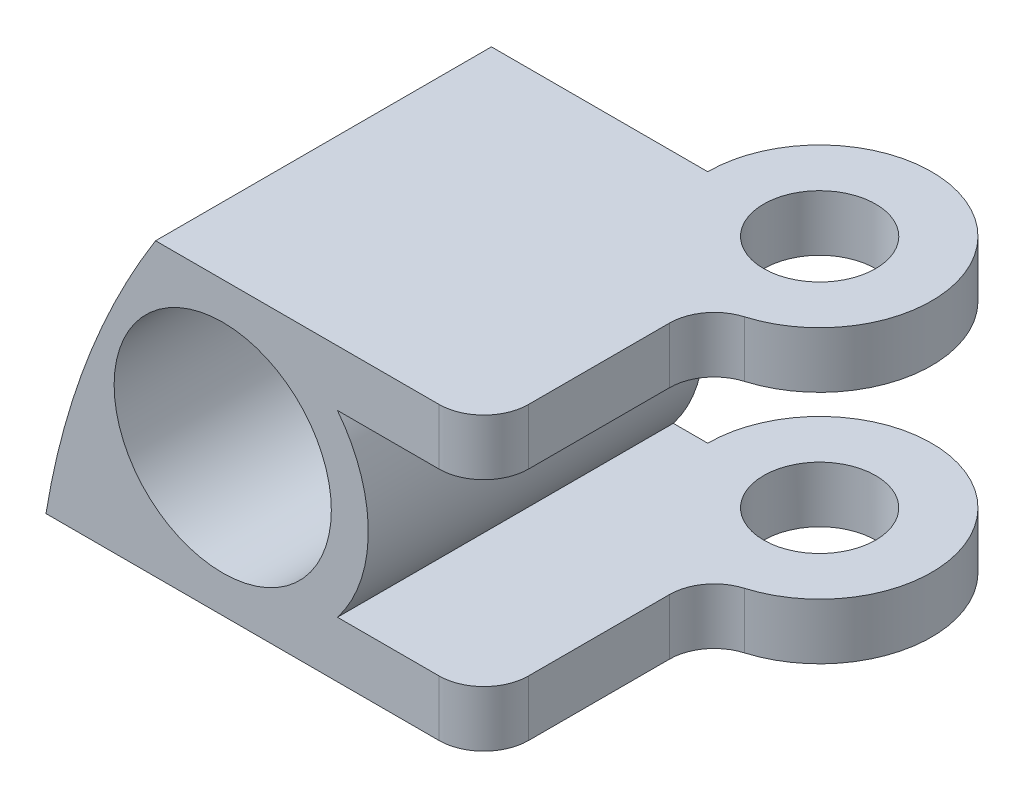
ISO-10303-21;
HEADER;
FILE_DESCRIPTION(('STEP AP214'),'2;1');
FILE_NAME('part.step','',(''),(''),'','','');
FILE_SCHEMA(('AUTOMOTIVE_DESIGN { 1 0 10303 214 1 1 1 1 }'));
ENDSEC;
DATA;
#1=APPLICATION_CONTEXT('core data for automotive mechanical design processes');
#2=APPLICATION_PROTOCOL_DEFINITION('international standard','automotive_design',2000,#1);
#3=PRODUCT_CONTEXT('',#1,'mechanical');
#4=PRODUCT('Part','Part','',(#3));
#5=PRODUCT_RELATED_PRODUCT_CATEGORY('part','',(#4));
#6=PRODUCT_DEFINITION_FORMATION('','',#4);
#7=PRODUCT_DEFINITION_CONTEXT('part definition',#1,'design');
#8=PRODUCT_DEFINITION('design','',#6,#7);
#9=PRODUCT_DEFINITION_SHAPE('','',#8);
#10=(LENGTH_UNIT() NAMED_UNIT(*) SI_UNIT(.MILLI.,.METRE.));
#11=(NAMED_UNIT(*) PLANE_ANGLE_UNIT() SI_UNIT($,.RADIAN.));
#12=(NAMED_UNIT(*) SI_UNIT($,.STERADIAN.) SOLID_ANGLE_UNIT());
#13=UNCERTAINTY_MEASURE_WITH_UNIT(LENGTH_MEASURE(1.E-05),#10,'distance_accuracy_value','');
#14=(GEOMETRIC_REPRESENTATION_CONTEXT(3) GLOBAL_UNCERTAINTY_ASSIGNED_CONTEXT((#13)) GLOBAL_UNIT_ASSIGNED_CONTEXT((#10,
#11,#12)) REPRESENTATION_CONTEXT('',''));
#15=CARTESIAN_POINT('',(0.,0.,0.));
#16=DIRECTION('',(0.,0.,1.));
#17=DIRECTION('',(1.,0.,0.));
#18=AXIS2_PLACEMENT_3D('',#15,#16,#17);
#19=CARTESIAN_POINT('',(-33.8574358250765,15.3458200795581,25.4));
#20=DIRECTION('',(0.,0.,1.));
#21=DIRECTION('',(1.,0.,0.));
#22=AXIS2_PLACEMENT_3D('',#19,#20,#21);
#23=PLANE('',#22);
#24=DIRECTION('',(1.,0.,0.));
#25=VECTOR('',#24,1.);
#26=CARTESIAN_POINT('',(-43.8807790564313,7.09082007955806,25.4));
#27=LINE('',#26,#25);
#28=CARTESIAN_POINT('',(-43.8807790564313,7.09082007955806,25.4));
#29=VERTEX_POINT('',#28);
#30=CARTESIAN_POINT('',(-21.59,7.09082007955806,25.4));
#31=VERTEX_POINT('',#30);
#32=EDGE_CURVE('E314',#29,#31,#27,.T.);
#33=ORIENTED_EDGE('',*,*,#32,.T.);
#34=DIRECTION('',(0.,1.,0.));
#35=VECTOR('',#34,1.);
#36=CARTESIAN_POINT('',(-21.59,10.2658200795581,25.4));
#37=LINE('',#36,#35);
#38=CARTESIAN_POINT('',(-21.59,10.2658200795581,25.4));
#39=VERTEX_POINT('',#38);
#40=EDGE_CURVE('E303',#31,#39,#37,.T.);
#41=ORIENTED_EDGE('',*,*,#40,.T.);
#42=DIRECTION('',(-1.,0.,0.));
#43=VECTOR('',#42,1.);
#44=CARTESIAN_POINT('',(-27.3506220886921,10.2658200795581,25.4));
#45=LINE('',#44,#43);
#46=CARTESIAN_POINT('',(-27.3506220886921,10.2658200795581,25.4));
#47=VERTEX_POINT('',#46);
#48=EDGE_CURVE('E322',#39,#47,#45,.T.);
#49=ORIENTED_EDGE('',*,*,#48,.T.);
#50=CARTESIAN_POINT('',(-33.8574358250765,15.3458200795581,25.4));
#51=DIRECTION('',(0.,0.,1.));
#52=DIRECTION('',(1.,0.,0.));
#53=AXIS2_PLACEMENT_3D('',#50,#51,#52);
#54=CIRCLE('',#53,8.255);
#55=CARTESIAN_POINT('',(-27.3506220886921,20.4258200795581,25.4));
#56=VERTEX_POINT('',#55);
#57=EDGE_CURVE('E362',#47,#56,#54,.T.);
#58=ORIENTED_EDGE('',*,*,#57,.T.);
#59=DIRECTION('',(1.,0.,0.));
#60=VECTOR('',#59,1.);
#61=CARTESIAN_POINT('',(-27.3506220886921,20.4258200795581,25.4));
#62=LINE('',#61,#60);
#63=CARTESIAN_POINT('',(-21.59,20.4258200795581,25.4));
#64=VERTEX_POINT('',#63);
#65=EDGE_CURVE('E265',#56,#64,#62,.T.);
#66=ORIENTED_EDGE('',*,*,#65,.T.);
#67=DIRECTION('',(0.,1.,0.));
#68=VECTOR('',#67,1.);
#69=CARTESIAN_POINT('',(-21.59,23.6008200795581,25.4));
#70=LINE('',#69,#68);
#71=CARTESIAN_POINT('',(-21.59,23.6008200795581,25.4));
#72=VERTEX_POINT('',#71);
#73=EDGE_CURVE('E300',#64,#72,#70,.T.);
#74=ORIENTED_EDGE('',*,*,#73,.T.);
#75=DIRECTION('',(-1.,0.,0.));
#76=VECTOR('',#75,1.);
#77=CARTESIAN_POINT('',(-37.6670119809407,23.6008200795581,25.4));
#78=LINE('',#77,#76);
#79=CARTESIAN_POINT('',(-37.6670119809407,23.6008200795581,25.4));
#80=VERTEX_POINT('',#79);
#81=EDGE_CURVE('E363',#72,#80,#78,.T.);
#82=ORIENTED_EDGE('',*,*,#81,.T.);
#83=CARTESIAN_POINT('',(0.,0.,25.4));
#84=DIRECTION('',(0.,0.,1.));
#85=DIRECTION('',(-1.,0.,0.));
#86=AXIS2_PLACEMENT_3D('',#83,#84,#85);
#87=CIRCLE('',#86,44.45);
#88=EDGE_CURVE('E321',#80,#29,#87,.T.);
#89=ORIENTED_EDGE('',*,*,#88,.T.);
#90=EDGE_LOOP('',(#33,#41,#49,#58,#66,#74,#82,#89));
#91=FACE_BOUND('',#90,.T.);
#92=CARTESIAN_POINT('',(-33.8574358250765,15.3458200795581,25.4));
#93=DIRECTION('',(0.,0.,1.));
#94=DIRECTION('',(1.,0.,0.));
#95=AXIS2_PLACEMENT_3D('',#92,#93,#94);
#96=CIRCLE('',#95,6.1595);
#97=CARTESIAN_POINT('',(-27.6979358250765,15.3458200795581,25.4));
#98=VERTEX_POINT('',#97);
#99=EDGE_CURVE('E366',#98,#98,#96,.T.);
#100=ORIENTED_EDGE('',*,*,#99,.F.);
#101=EDGE_LOOP('',(#100));
#102=FACE_BOUND('',#101,.T.);
#103=ADVANCED_FACE('F34',(#91,#102),#23,.T.);
#104=CARTESIAN_POINT('',(-33.8574358250765,15.3458200795581,25.4));
#105=DIRECTION('',(0.,0.,-1.));
#106=DIRECTION('',(-1.,0.,0.));
#107=AXIS2_PLACEMENT_3D('',#104,#105,#106);
#108=CYLINDRICAL_SURFACE('',#107,8.255);
#109=DIRECTION('',(0.,0.,-1.));
#110=VECTOR('',#109,1.);
#111=CARTESIAN_POINT('',(-27.3506220886921,10.2658200795581,25.4));
#112=LINE('',#111,#110);
#113=CARTESIAN_POINT('',(-27.3506220886921,10.2658200795581,6.35));
#114=VERTEX_POINT('',#113);
#115=EDGE_CURVE('E372',#47,#114,#112,.T.);
#116=ORIENTED_EDGE('',*,*,#115,.T.);
#117=CARTESIAN_POINT('',(-33.8574358250765,15.3458200795581,6.35));
#118=DIRECTION('',(0.,0.,1.));
#119=DIRECTION('',(1.,0.,0.));
#120=AXIS2_PLACEMENT_3D('',#117,#118,#119);
#121=CIRCLE('',#120,8.255);
#122=CARTESIAN_POINT('',(-27.3506220886921,20.4258200795581,6.35));
#123=VERTEX_POINT('',#122);
#124=EDGE_CURVE('E187',#114,#123,#121,.T.);
#125=ORIENTED_EDGE('',*,*,#124,.T.);
#126=DIRECTION('',(0.,0.,-1.));
#127=VECTOR('',#126,1.);
#128=CARTESIAN_POINT('',(-27.3506220886921,20.4258200795581,25.4));
#129=LINE('',#128,#127);
#130=EDGE_CURVE('E263',#56,#123,#129,.T.);
#131=ORIENTED_EDGE('',*,*,#130,.F.);
#132=ORIENTED_EDGE('',*,*,#57,.F.);
#133=EDGE_LOOP('',(#116,#125,#131,#132));
#134=FACE_BOUND('',#133,.T.);
#135=ADVANCED_FACE('F232',(#134),#108,.T.);
#136=CARTESIAN_POINT('',(-27.3506220886921,20.4258200795581,25.4));
#137=DIRECTION('',(0.,1.,0.));
#138=DIRECTION('',(0.,0.,1.));
#139=AXIS2_PLACEMENT_3D('',#136,#137,#138);
#140=PLANE('',#139);
#141=DIRECTION('',(0.,0.,1.));
#142=VECTOR('',#141,1.);
#143=CARTESIAN_POINT('',(-19.05,20.4258200795581,25.4));
#144=LINE('',#143,#142);
#145=CARTESIAN_POINT('',(-19.05,20.4258200795581,14.8694189942742));
#146=VERTEX_POINT('',#145);
#147=CARTESIAN_POINT('',(-19.05,20.4258200795581,22.86));
#148=VERTEX_POINT('',#147);
#149=EDGE_CURVE('E198',#146,#148,#144,.T.);
#150=ORIENTED_EDGE('',*,*,#149,.T.);
#151=CARTESIAN_POINT('',(-21.59,20.4258200795581,22.86));
#152=DIRECTION('',(0.,1.,0.));
#153=DIRECTION('',(0.,0.,1.));
#154=AXIS2_PLACEMENT_3D('',#151,#152,#153);
#155=CIRCLE('',#154,2.54);
#156=EDGE_CURVE('E11',#148,#64,#155,.F.);
#157=ORIENTED_EDGE('',*,*,#156,.T.);
#158=ORIENTED_EDGE('',*,*,#65,.F.);
#159=ORIENTED_EDGE('',*,*,#130,.T.);
#160=DIRECTION('',(1.,0.,0.));
#161=VECTOR('',#160,1.);
#162=CARTESIAN_POINT('',(-27.3506220886921,20.4258200795581,6.35));
#163=LINE('',#162,#161);
#164=CARTESIAN_POINT('',(-25.4,20.4258200795581,6.35));
#165=VERTEX_POINT('',#164);
#166=EDGE_CURVE('E190',#123,#165,#163,.T.);
#167=ORIENTED_EDGE('',*,*,#166,.T.);
#168=CARTESIAN_POINT('',(-19.05,20.4258200795581,6.35));
#169=DIRECTION('',(0.,1.,0.));
#170=DIRECTION('',(0.,0.,1.));
#171=AXIS2_PLACEMENT_3D('',#168,#169,#170);
#172=CIRCLE('',#171,6.35);
#173=CARTESIAN_POINT('',(-17.2357142857143,20.4258200795581,12.4352992816244));
#174=VERTEX_POINT('',#173);
#175=EDGE_CURVE('E195',#165,#174,#172,.F.);
#176=ORIENTED_EDGE('',*,*,#175,.T.);
#177=CARTESIAN_POINT('',(-16.51,20.4258200795581,14.8694189942742));
#178=DIRECTION('',(0.,1.,0.));
#179=DIRECTION('',(0.,0.,1.));
#180=AXIS2_PLACEMENT_3D('',#177,#178,#179);
#181=CIRCLE('',#180,2.54);
#182=EDGE_CURVE('E294',#174,#146,#181,.T.);
#183=ORIENTED_EDGE('',*,*,#182,.T.);
#184=EDGE_LOOP('',(#150,#157,#158,#159,#167,#176,#183));
#185=FACE_BOUND('',#184,.T.);
#186=CARTESIAN_POINT('',(-19.05,20.4258200795581,6.35));
#187=DIRECTION('',(0.,1.,0.));
#188=DIRECTION('',(0.,0.,1.));
#189=AXIS2_PLACEMENT_3D('',#186,#187,#188);
#190=CIRCLE('',#189,3.175);
#191=CARTESIAN_POINT('',(-19.05,20.4258200795581,9.525));
#192=VERTEX_POINT('',#191);
#193=EDGE_CURVE('E495',#192,#192,#190,.T.);
#194=ORIENTED_EDGE('',*,*,#193,.T.);
#195=EDGE_LOOP('',(#194));
#196=FACE_BOUND('',#195,.T.);
#197=ADVANCED_FACE('F246',(#185,#196),#140,.F.);
#198=CARTESIAN_POINT('',(-37.6670119809407,23.6008200795581,25.4));
#199=DIRECTION('',(0.,-1.,0.));
#200=DIRECTION('',(0.,0.,-1.));
#201=AXIS2_PLACEMENT_3D('',#198,#199,#200);
#202=PLANE('',#201);
#203=ORIENTED_EDGE('',*,*,#81,.F.);
#204=CARTESIAN_POINT('',(-21.59,23.6008200795581,22.86));
#205=DIRECTION('',(0.,-1.,0.));
#206=DIRECTION('',(0.,0.,-1.));
#207=AXIS2_PLACEMENT_3D('',#204,#205,#206);
#208=CIRCLE('',#207,2.54);
#209=CARTESIAN_POINT('',(-19.05,23.6008200795581,22.86));
#210=VERTEX_POINT('',#209);
#211=EDGE_CURVE('E56',#72,#210,#208,.F.);
#212=ORIENTED_EDGE('',*,*,#211,.T.);
#213=DIRECTION('',(0.,0.,1.));
#214=VECTOR('',#213,1.);
#215=CARTESIAN_POINT('',(-19.05,23.6008200795581,12.7));
#216=LINE('',#215,#214);
#217=CARTESIAN_POINT('',(-19.05,23.6008200795581,14.8694189942742));
#218=VERTEX_POINT('',#217);
#219=EDGE_CURVE('E171',#218,#210,#216,.T.);
#220=ORIENTED_EDGE('',*,*,#219,.F.);
#221=CARTESIAN_POINT('',(-16.51,23.6008200795581,14.8694189942742));
#222=DIRECTION('',(0.,-1.,0.));
#223=DIRECTION('',(0.,0.,-1.));
#224=AXIS2_PLACEMENT_3D('',#221,#222,#223);
#225=CIRCLE('',#224,2.54);
#226=CARTESIAN_POINT('',(-17.2357142857143,23.6008200795581,12.4352992816244));
#227=VERTEX_POINT('',#226);
#228=EDGE_CURVE('E255',#218,#227,#225,.T.);
#229=ORIENTED_EDGE('',*,*,#228,.T.);
#230=CARTESIAN_POINT('',(-19.05,23.6008200795581,6.35));
#231=DIRECTION('',(0.,-1.,0.));
#232=DIRECTION('',(0.,0.,1.));
#233=AXIS2_PLACEMENT_3D('',#230,#231,#232);
#234=CIRCLE('',#233,6.35);
#235=CARTESIAN_POINT('',(-25.4,23.6008200795581,6.35));
#236=VERTEX_POINT('',#235);
#237=EDGE_CURVE('E173',#236,#227,#234,.T.);
#238=ORIENTED_EDGE('',*,*,#237,.F.);
#239=DIRECTION('',(1.,0.,0.));
#240=VECTOR('',#239,1.);
#241=CARTESIAN_POINT('',(-40.64,23.6008200795581,6.35));
#242=LINE('',#241,#240);
#243=CARTESIAN_POINT('',(-37.6670119809407,23.6008200795581,6.35));
#244=VERTEX_POINT('',#243);
#245=EDGE_CURVE('E178',#244,#236,#242,.T.);
#246=ORIENTED_EDGE('',*,*,#245,.F.);
#247=DIRECTION('',(0.,0.,-1.));
#248=VECTOR('',#247,1.);
#249=CARTESIAN_POINT('',(-37.6670119809407,23.6008200795581,25.4));
#250=LINE('',#249,#248);
#251=EDGE_CURVE('E250',#80,#244,#250,.T.);
#252=ORIENTED_EDGE('',*,*,#251,.F.);
#253=EDGE_LOOP('',(#203,#212,#220,#229,#238,#246,#252));
#254=FACE_BOUND('',#253,.T.);
#255=CARTESIAN_POINT('',(-19.05,23.6008200795581,6.35));
#256=DIRECTION('',(0.,1.,0.));
#257=DIRECTION('',(0.,0.,1.));
#258=AXIS2_PLACEMENT_3D('',#255,#256,#257);
#259=CIRCLE('',#258,3.175);
#260=CARTESIAN_POINT('',(-19.05,23.6008200795581,9.525));
#261=VERTEX_POINT('',#260);
#262=EDGE_CURVE('E207',#261,#261,#259,.T.);
#263=ORIENTED_EDGE('',*,*,#262,.F.);
#264=EDGE_LOOP('',(#263));
#265=FACE_BOUND('',#264,.T.);
#266=ADVANCED_FACE('F241',(#254,#265),#202,.F.);
#267=CARTESIAN_POINT('',(0.,0.,25.4));
#268=DIRECTION('',(0.,0.,-1.));
#269=DIRECTION('',(-1.,0.,0.));
#270=AXIS2_PLACEMENT_3D('',#267,#268,#269);
#271=CYLINDRICAL_SURFACE('',#270,44.45);
#272=CARTESIAN_POINT('',(0.,0.,6.35));
#273=DIRECTION('',(0.,0.,1.));
#274=DIRECTION('',(1.,0.,0.));
#275=AXIS2_PLACEMENT_3D('',#272,#273,#274);
#276=CIRCLE('',#275,44.45);
#277=CARTESIAN_POINT('',(-40.64,18.0053575360224,6.35));
#278=VERTEX_POINT('',#277);
#279=EDGE_CURVE('E193',#244,#278,#276,.T.);
#280=ORIENTED_EDGE('',*,*,#279,.T.);
#281=CARTESIAN_POINT('',(-40.64,18.0053575360224,6.35));
#282=CARTESIAN_POINT('',(-40.6399858684762,18.0053850674031,6.42860205927988));
#283=CARTESIAN_POINT('',(-40.6414589667043,18.0020644090249,6.50718713842052));
#284=CARTESIAN_POINT('',(-40.6472714524176,17.9889387291809,6.6636382192536));
#285=CARTESIAN_POINT('',(-40.6516082538039,17.979139558198,6.74150480551763));
#286=CARTESIAN_POINT('',(-40.6629877454723,17.953387179122,6.89526719531025));
#287=CARTESIAN_POINT('',(-40.670005174567,17.9374914174421,6.97117453940111));
#288=CARTESIAN_POINT('',(-40.6865585221489,17.8999128340143,7.12125351985808));
#289=CARTESIAN_POINT('',(-40.6960948907276,17.8782289780255,7.19542484344604));
#290=CARTESIAN_POINT('',(-40.7280809302924,17.8053006165963,7.41418329624837));
#291=CARTESIAN_POINT('',(-40.7539593059729,17.7460632897751,7.55567326486585));
#292=CARTESIAN_POINT('',(-40.8129268155589,17.6100265474026,7.82846613663836));
#293=CARTESIAN_POINT('',(-40.8460337895425,17.5331836580071,7.95974272639628));
#294=CARTESIAN_POINT('',(-40.9432545484435,17.3053912774347,8.30191851672014));
#295=CARTESIAN_POINT('',(-41.0125677515992,17.1408389041428,8.50233665325664));
#296=CARTESIAN_POINT('',(-41.1227473901252,16.8739931244987,8.78060266897358));
#297=CARTESIAN_POINT('',(-41.160581652018,16.7815262143035,8.86976949615618));
#298=CARTESIAN_POINT('',(-41.2377412537271,16.5910131308004,9.0412530228011));
#299=CARTESIAN_POINT('',(-41.2770662713191,16.492968160912,9.1235711904387));
#300=CARTESIAN_POINT('',(-41.3892881018672,16.2101141877237,9.34676355510312));
#301=CARTESIAN_POINT('',(-41.4632986423793,16.0200194827513,9.48036971614077));
#302=CARTESIAN_POINT('',(-41.612304225724,15.6289016411106,9.72993927328907));
#303=CARTESIAN_POINT('',(-41.687300072299,15.4278691004059,9.84588715128312));
#304=CARTESIAN_POINT('',(-41.8369591075026,15.0172968330521,10.0629604635134));
#305=CARTESIAN_POINT('',(-41.9116212420885,14.8077398368429,10.1640536771114));
#306=CARTESIAN_POINT('',(-42.0594463948925,14.3824948297918,10.3533162747553));
#307=CARTESIAN_POINT('',(-42.1326098434426,14.1668086225886,10.4414894147122));
#308=CARTESIAN_POINT('',(-42.2840664126217,13.7085444117589,10.6151224590177));
#309=CARTESIAN_POINT('',(-42.3621317889708,13.4654496892092,10.6994099343058));
#310=CARTESIAN_POINT('',(-42.5150453128146,12.9745731407807,10.8565832502906));
#311=CARTESIAN_POINT('',(-42.5898926791861,12.7267901976925,10.9294663339493));
#312=CARTESIAN_POINT('',(-42.7359817981814,12.2272704887145,11.0654845232775));
#313=CARTESIAN_POINT('',(-42.8072201931958,11.9755303164475,11.1286106595937));
#314=CARTESIAN_POINT('',(-42.9457122756752,11.4689695287864,11.2463756369765));
#315=CARTESIAN_POINT('',(-43.012965494977,11.2141485556887,11.3010134820888));
#316=CARTESIAN_POINT('',(-43.1432601708625,10.7019363824853,11.4029135052793));
#317=CARTESIAN_POINT('',(-43.2063010465743,10.4445448335055,11.4501746673263));
#318=CARTESIAN_POINT('',(-43.3279970552494,9.92762373124177,11.5382422780082));
#319=CARTESIAN_POINT('',(-43.3866518278721,9.66809400423591,11.5790481966186));
#320=CARTESIAN_POINT('',(-43.5557643325157,8.88714520807768,11.6929499554332));
#321=CARTESIAN_POINT('',(-43.6594672686087,8.3629857111762,11.7576028532993));
#322=CARTESIAN_POINT('',(-43.7760131513114,7.71226899882168,11.8266259838594));
#323=CARTESIAN_POINT('',(-43.7977140320062,7.5880611330193,11.8392985217988));
#324=CARTESIAN_POINT('',(-43.8400424608099,7.33955210516721,11.8636986749844));
#325=CARTESIAN_POINT('',(-43.8606714812607,7.21525132251778,11.8754275992517));
#326=CARTESIAN_POINT('',(-43.8807790564313,7.09082007955806,11.8867179017965));
#327=B_SPLINE_CURVE_WITH_KNOTS('',3,(#281,#282,#283,#284,#285,#286,#287,#288,#289,#290,#291,
#292,#293,#294,#295,#296,#297,#298,#299,#300,#301,#302,#303,#304,#305,#306,#307,#308,#309,#310,
#311,#312,#313,#314,#315,#316,#317,#318,#319,#320,#321,#322,#323,#324,#325,#326),.UNSPECIFIED.,
.F.,.F.,(4,2,2,2,2,2,2,2,2,2,2,2,2,2,2,2,2,2,2,2,2,2,4),(0.,0.235694740019568,0.471176923855376,
0.704492676434341,0.937850146784164,1.4025774760099,1.86846497782513,2.66874785915352,
3.07031815307747,3.47180213771034,4.20215206583604,4.93314016787749,5.66569113444536,
6.39802872157083,7.20429450491854,8.01075490473667,8.81795231266198,9.62524435983153,
10.4326475018449,11.2401169034104,12.8538582290616,13.2340305774573,13.6136660991286),.UNSPECIFIED.);
#328=CARTESIAN_POINT('',(-43.8807790564313,7.09082007955806,11.8867179017965));
#329=VERTEX_POINT('',#328);
#330=EDGE_CURVE('E146',#278,#329,#327,.T.);
#331=ORIENTED_EDGE('',*,*,#330,.T.);
#332=DIRECTION('',(0.,0.,-1.));
#333=VECTOR('',#332,1.);
#334=CARTESIAN_POINT('',(-43.8807790564313,7.09082007955806,25.4));
#335=LINE('',#334,#333);
#336=EDGE_CURVE('E170',#29,#329,#335,.T.);
#337=ORIENTED_EDGE('',*,*,#336,.F.);
#338=ORIENTED_EDGE('',*,*,#88,.F.);
#339=ORIENTED_EDGE('',*,*,#251,.T.);
#340=EDGE_LOOP('',(#280,#331,#337,#338,#339));
#341=FACE_BOUND('',#340,.T.);
#342=ADVANCED_FACE('F209',(#341),#271,.T.);
#343=CARTESIAN_POINT('',(-43.8807790564313,7.09082007955806,25.4));
#344=DIRECTION('',(0.,1.,0.));
#345=DIRECTION('',(0.,0.,1.));
#346=AXIS2_PLACEMENT_3D('',#343,#344,#345);
#347=PLANE('',#346);
#348=DIRECTION('',(0.,0.,1.));
#349=VECTOR('',#348,1.);
#350=CARTESIAN_POINT('',(-19.05,7.09082007955806,12.7));
#351=LINE('',#350,#349);
#352=CARTESIAN_POINT('',(-19.05,7.09082007955806,14.8694189942742));
#353=VERTEX_POINT('',#352);
#354=CARTESIAN_POINT('',(-19.05,7.09082007955806,22.86));
#355=VERTEX_POINT('',#354);
#356=EDGE_CURVE('E150',#353,#355,#351,.T.);
#357=ORIENTED_EDGE('',*,*,#356,.T.);
#358=CARTESIAN_POINT('',(-21.59,7.09082007955806,22.86));
#359=DIRECTION('',(0.,1.,0.));
#360=DIRECTION('',(0.,0.,1.));
#361=AXIS2_PLACEMENT_3D('',#358,#359,#360);
#362=CIRCLE('',#361,2.54);
#363=EDGE_CURVE('E310',#355,#31,#362,.F.);
#364=ORIENTED_EDGE('',*,*,#363,.T.);
#365=ORIENTED_EDGE('',*,*,#32,.F.);
#366=ORIENTED_EDGE('',*,*,#336,.T.);
#367=CARTESIAN_POINT('',(-46.99,7.09082007955806,6.35));
#368=DIRECTION('',(0.,1.,0.));
#369=DIRECTION('',(0.,0.,1.));
#370=AXIS2_PLACEMENT_3D('',#367,#368,#369);
#371=CIRCLE('',#370,6.35);
#372=CARTESIAN_POINT('',(-40.64,7.09082007955806,6.35));
#373=VERTEX_POINT('',#372);
#374=EDGE_CURVE('E144',#329,#373,#371,.T.);
#375=ORIENTED_EDGE('',*,*,#374,.T.);
#376=DIRECTION('',(1.,0.,0.));
#377=VECTOR('',#376,1.);
#378=CARTESIAN_POINT('',(-40.64,7.09082007955806,6.35));
#379=LINE('',#378,#377);
#380=CARTESIAN_POINT('',(-25.4,7.09082007955806,6.35));
#381=VERTEX_POINT('',#380);
#382=EDGE_CURVE('E154',#373,#381,#379,.T.);
#383=ORIENTED_EDGE('',*,*,#382,.T.);
#384=CARTESIAN_POINT('',(-19.05,7.09082007955806,6.35));
#385=DIRECTION('',(0.,-1.,0.));
#386=DIRECTION('',(0.,0.,1.));
#387=AXIS2_PLACEMENT_3D('',#384,#385,#386);
#388=CIRCLE('',#387,6.35);
#389=CARTESIAN_POINT('',(-17.2357142857143,7.09082007955806,12.4352992816244));
#390=VERTEX_POINT('',#389);
#391=EDGE_CURVE('E162',#381,#390,#388,.T.);
#392=ORIENTED_EDGE('',*,*,#391,.T.);
#393=CARTESIAN_POINT('',(-16.51,7.09082007955806,14.8694189942742));
#394=DIRECTION('',(0.,1.,0.));
#395=DIRECTION('',(0.,0.,1.));
#396=AXIS2_PLACEMENT_3D('',#393,#394,#395);
#397=CIRCLE('',#396,2.54);
#398=EDGE_CURVE('E298',#390,#353,#397,.T.);
#399=ORIENTED_EDGE('',*,*,#398,.T.);
#400=EDGE_LOOP('',(#357,#364,#365,#366,#375,#383,#392,#399));
#401=FACE_BOUND('',#400,.T.);
#402=CARTESIAN_POINT('',(-19.05,7.09082007955806,6.35));
#403=DIRECTION('',(0.,1.,0.));
#404=DIRECTION('',(0.,0.,1.));
#405=AXIS2_PLACEMENT_3D('',#402,#403,#404);
#406=CIRCLE('',#405,3.175);
#407=CARTESIAN_POINT('',(-19.05,7.09082007955806,9.525));
#408=VERTEX_POINT('',#407);
#409=EDGE_CURVE('E279',#408,#408,#406,.T.);
#410=ORIENTED_EDGE('',*,*,#409,.T.);
#411=EDGE_LOOP('',(#410));
#412=FACE_BOUND('',#411,.T.);
#413=ADVANCED_FACE('F166',(#401,#412),#347,.F.);
#414=CARTESIAN_POINT('',(-27.3506220886921,10.2658200795581,25.4));
#415=DIRECTION('',(0.,-1.,0.));
#416=DIRECTION('',(0.,0.,-1.));
#417=AXIS2_PLACEMENT_3D('',#414,#415,#416);
#418=PLANE('',#417);
#419=ORIENTED_EDGE('',*,*,#48,.F.);
#420=CARTESIAN_POINT('',(-21.59,10.2658200795581,22.86));
#421=DIRECTION('',(0.,-1.,0.));
#422=DIRECTION('',(0.,0.,-1.));
#423=AXIS2_PLACEMENT_3D('',#420,#421,#422);
#424=CIRCLE('',#423,2.54);
#425=CARTESIAN_POINT('',(-19.05,10.2658200795581,22.86));
#426=VERTEX_POINT('',#425);
#427=EDGE_CURVE('E306',#39,#426,#424,.F.);
#428=ORIENTED_EDGE('',*,*,#427,.T.);
#429=DIRECTION('',(0.,0.,-1.));
#430=VECTOR('',#429,1.);
#431=CARTESIAN_POINT('',(-19.05,10.2658200795581,25.4));
#432=LINE('',#431,#430);
#433=CARTESIAN_POINT('',(-19.05,10.2658200795581,14.8694189942742));
#434=VERTEX_POINT('',#433);
#435=EDGE_CURVE('E271',#426,#434,#432,.T.);
#436=ORIENTED_EDGE('',*,*,#435,.T.);
#437=CARTESIAN_POINT('',(-16.51,10.2658200795581,14.8694189942742));
#438=DIRECTION('',(0.,-1.,0.));
#439=DIRECTION('',(0.,0.,-1.));
#440=AXIS2_PLACEMENT_3D('',#437,#438,#439);
#441=CIRCLE('',#440,2.54);
#442=CARTESIAN_POINT('',(-17.2357142857143,10.2658200795581,12.4352992816244));
#443=VERTEX_POINT('',#442);
#444=EDGE_CURVE('E296',#434,#443,#441,.T.);
#445=ORIENTED_EDGE('',*,*,#444,.T.);
#446=CARTESIAN_POINT('',(-19.05,10.2658200795581,6.35));
#447=DIRECTION('',(0.,-1.,0.));
#448=DIRECTION('',(0.,0.,-1.));
#449=AXIS2_PLACEMENT_3D('',#446,#447,#448);
#450=CIRCLE('',#449,6.35);
#451=CARTESIAN_POINT('',(-25.4,10.2658200795581,6.35));
#452=VERTEX_POINT('',#451);
#453=EDGE_CURVE('E269',#443,#452,#450,.F.);
#454=ORIENTED_EDGE('',*,*,#453,.T.);
#455=DIRECTION('',(-1.,0.,0.));
#456=VECTOR('',#455,1.);
#457=CARTESIAN_POINT('',(-27.3506220886921,10.2658200795581,6.35));
#458=LINE('',#457,#456);
#459=EDGE_CURVE('E184',#452,#114,#458,.T.);
#460=ORIENTED_EDGE('',*,*,#459,.T.);
#461=ORIENTED_EDGE('',*,*,#115,.F.);
#462=EDGE_LOOP('',(#419,#428,#436,#445,#454,#460,#461));
#463=FACE_BOUND('',#462,.T.);
#464=CARTESIAN_POINT('',(-19.05,10.2658200795581,6.35));
#465=DIRECTION('',(0.,-1.,0.));
#466=DIRECTION('',(0.,0.,-1.));
#467=AXIS2_PLACEMENT_3D('',#464,#465,#466);
#468=CIRCLE('',#467,3.175);
#469=CARTESIAN_POINT('',(-19.05,10.2658200795581,3.175));
#470=VERTEX_POINT('',#469);
#471=EDGE_CURVE('E276',#470,#470,#468,.T.);
#472=ORIENTED_EDGE('',*,*,#471,.T.);
#473=EDGE_LOOP('',(#472));
#474=FACE_BOUND('',#473,.T.);
#475=ADVANCED_FACE('F228',(#463,#474),#418,.F.);
#476=CARTESIAN_POINT('',(-33.8574358250765,15.3458200795581,25.4));
#477=DIRECTION('',(0.,0.,-1.));
#478=DIRECTION('',(-1.,0.,0.));
#479=AXIS2_PLACEMENT_3D('',#476,#477,#478);
#480=CYLINDRICAL_SURFACE('',#479,6.1595);
#481=CARTESIAN_POINT('',(-33.8574358250765,15.3458200795581,6.35));
#482=DIRECTION('',(0.,0.,1.));
#483=DIRECTION('',(1.,0.,0.));
#484=AXIS2_PLACEMENT_3D('',#481,#482,#483);
#485=CIRCLE('',#484,6.1595);
#486=CARTESIAN_POINT('',(-27.6979358250765,15.3458200795581,6.35));
#487=VERTEX_POINT('',#486);
#488=EDGE_CURVE('E182',#487,#487,#485,.T.);
#489=ORIENTED_EDGE('',*,*,#488,.F.);
#490=EDGE_LOOP('',(#489));
#491=FACE_BOUND('',#490,.T.);
#492=ORIENTED_EDGE('',*,*,#99,.T.);
#493=EDGE_LOOP('',(#492));
#494=FACE_BOUND('',#493,.T.);
#495=ADVANCED_FACE('F225',(#491,#494),#480,.F.);
#496=CARTESIAN_POINT('',(-19.05,-1.79917992044194,6.35));
#497=DIRECTION('',(0.,1.,0.));
#498=DIRECTION('',(0.,0.,1.));
#499=AXIS2_PLACEMENT_3D('',#496,#497,#498);
#500=CYLINDRICAL_SURFACE('',#499,3.175);
#501=ORIENTED_EDGE('',*,*,#471,.F.);
#502=EDGE_LOOP('',(#501));
#503=FACE_BOUND('',#502,.T.);
#504=ORIENTED_EDGE('',*,*,#409,.F.);
#505=EDGE_LOOP('',(#504));
#506=FACE_BOUND('',#505,.T.);
#507=ADVANCED_FACE('F223',(#503,#506),#500,.F.);
#508=ORIENTED_EDGE('',*,*,#262,.T.);
#509=EDGE_LOOP('',(#508));
#510=FACE_BOUND('',#509,.T.);
#511=ORIENTED_EDGE('',*,*,#193,.F.);
#512=EDGE_LOOP('',(#511));
#513=FACE_BOUND('',#512,.T.);
#514=ADVANCED_FACE('F220',(#510,#513),#500,.F.);
#515=CARTESIAN_POINT('',(-40.64,7.09082007955806,6.35));
#516=DIRECTION('',(0.,0.,1.));
#517=DIRECTION('',(1.,0.,0.));
#518=AXIS2_PLACEMENT_3D('',#515,#516,#517);
#519=PLANE('',#518);
#520=ORIENTED_EDGE('',*,*,#488,.T.);
#521=EDGE_LOOP('',(#520));
#522=FACE_BOUND('',#521,.T.);
#523=ORIENTED_EDGE('',*,*,#245,.T.);
#524=DIRECTION('',(0.,1.,0.));
#525=VECTOR('',#524,1.);
#526=CARTESIAN_POINT('',(-25.4,7.09082007955806,6.35));
#527=LINE('',#526,#525);
#528=EDGE_CURVE('E149',#165,#236,#527,.T.);
#529=ORIENTED_EDGE('',*,*,#528,.F.);
#530=ORIENTED_EDGE('',*,*,#166,.F.);
#531=ORIENTED_EDGE('',*,*,#124,.F.);
#532=ORIENTED_EDGE('',*,*,#459,.F.);
#533=EDGE_CURVE('E159',#381,#452,#527,.T.);
#534=ORIENTED_EDGE('',*,*,#533,.F.);
#535=ORIENTED_EDGE('',*,*,#382,.F.);
#536=DIRECTION('',(0.,1.,0.));
#537=VECTOR('',#536,1.);
#538=CARTESIAN_POINT('',(-40.64,7.09082007955806,6.35));
#539=LINE('',#538,#537);
#540=EDGE_CURVE('E140',#373,#278,#539,.T.);
#541=ORIENTED_EDGE('',*,*,#540,.T.);
#542=ORIENTED_EDGE('',*,*,#279,.F.);
#543=EDGE_LOOP('',(#523,#529,#530,#531,#532,#534,#535,#541,#542));
#544=FACE_BOUND('',#543,.T.);
#545=ADVANCED_FACE('F156',(#522,#544),#519,.F.);
#546=CARTESIAN_POINT('',(-19.05,7.09082007955806,6.35));
#547=DIRECTION('',(0.,1.,0.));
#548=DIRECTION('',(0.,0.,1.));
#549=AXIS2_PLACEMENT_3D('',#546,#547,#548);
#550=CYLINDRICAL_SURFACE('',#549,6.35);
#551=ORIENTED_EDGE('',*,*,#453,.F.);
#552=DIRECTION('',(0.,1.,0.));
#553=VECTOR('',#552,1.);
#554=CARTESIAN_POINT('',(-17.2357142857143,7.09082007955806,12.4352992816244));
#555=LINE('',#554,#553);
#556=EDGE_CURVE('E291',#443,#390,#555,.F.);
#557=ORIENTED_EDGE('',*,*,#556,.T.);
#558=ORIENTED_EDGE('',*,*,#391,.F.);
#559=ORIENTED_EDGE('',*,*,#533,.T.);
#560=EDGE_LOOP('',(#551,#557,#558,#559));
#561=FACE_BOUND('',#560,.T.);
#562=ADVANCED_FACE('F218',(#561),#550,.T.);
#563=CARTESIAN_POINT('',(-46.99,7.09082007955806,6.35));
#564=DIRECTION('',(0.,1.,0.));
#565=DIRECTION('',(0.,0.,1.));
#566=AXIS2_PLACEMENT_3D('',#563,#564,#565);
#567=CYLINDRICAL_SURFACE('',#566,6.35);
#568=ORIENTED_EDGE('',*,*,#540,.F.);
#569=ORIENTED_EDGE('',*,*,#374,.F.);
#570=ORIENTED_EDGE('',*,*,#330,.F.);
#571=EDGE_LOOP('',(#568,#569,#570));
#572=FACE_BOUND('',#571,.T.);
#573=ADVANCED_FACE('F142',(#572),#567,.F.);
#574=ORIENTED_EDGE('',*,*,#237,.T.);
#575=DIRECTION('',(0.,1.,0.));
#576=VECTOR('',#575,1.);
#577=CARTESIAN_POINT('',(-17.2357142857143,7.09082007955806,12.4352992816244));
#578=LINE('',#577,#576);
#579=EDGE_CURVE('E286',#227,#174,#578,.F.);
#580=ORIENTED_EDGE('',*,*,#579,.T.);
#581=ORIENTED_EDGE('',*,*,#175,.F.);
#582=ORIENTED_EDGE('',*,*,#528,.T.);
#583=EDGE_LOOP('',(#574,#580,#581,#582));
#584=FACE_BOUND('',#583,.T.);
#585=ADVANCED_FACE('F217',(#584),#550,.T.);
#586=CARTESIAN_POINT('',(-19.05,7.09082007955806,12.7));
#587=DIRECTION('',(-1.,0.,0.));
#588=DIRECTION('',(0.,0.,1.));
#589=AXIS2_PLACEMENT_3D('',#586,#587,#588);
#590=PLANE('',#589);
#591=ORIENTED_EDGE('',*,*,#435,.F.);
#592=DIRECTION('',(0.,1.,0.));
#593=VECTOR('',#592,1.);
#594=CARTESIAN_POINT('',(-19.05,7.09082007955806,22.86));
#595=LINE('',#594,#593);
#596=EDGE_CURVE('E308',#426,#355,#595,.F.);
#597=ORIENTED_EDGE('',*,*,#596,.T.);
#598=ORIENTED_EDGE('',*,*,#356,.F.);
#599=DIRECTION('',(0.,-1.,0.));
#600=VECTOR('',#599,1.);
#601=CARTESIAN_POINT('',(-19.05,10.2658200795581,14.8694189942742));
#602=LINE('',#601,#600);
#603=EDGE_CURVE('E288',#353,#434,#602,.F.);
#604=ORIENTED_EDGE('',*,*,#603,.T.);
#605=EDGE_LOOP('',(#591,#597,#598,#604));
#606=FACE_BOUND('',#605,.T.);
#607=ADVANCED_FACE('F330',(#606),#590,.F.);
#608=ORIENTED_EDGE('',*,*,#219,.T.);
#609=DIRECTION('',(0.,1.,0.));
#610=VECTOR('',#609,1.);
#611=CARTESIAN_POINT('',(-19.05,20.4258200795581,22.86));
#612=LINE('',#611,#610);
#613=EDGE_CURVE('E42',#210,#148,#612,.F.);
#614=ORIENTED_EDGE('',*,*,#613,.T.);
#615=ORIENTED_EDGE('',*,*,#149,.F.);
#616=DIRECTION('',(0.,-1.,0.));
#617=VECTOR('',#616,1.);
#618=CARTESIAN_POINT('',(-19.05,23.6008200795581,14.8694189942742));
#619=LINE('',#618,#617);
#620=EDGE_CURVE('E283',#146,#218,#619,.F.);
#621=ORIENTED_EDGE('',*,*,#620,.T.);
#622=EDGE_LOOP('',(#608,#614,#615,#621));
#623=FACE_BOUND('',#622,.T.);
#624=ADVANCED_FACE('F348',(#623),#590,.F.);
#625=CARTESIAN_POINT('',(-16.51,7.09082007955806,14.8694189942742));
#626=DIRECTION('',(0.,1.,0.));
#627=DIRECTION('',(0.,0.,1.));
#628=AXIS2_PLACEMENT_3D('',#625,#626,#627);
#629=CYLINDRICAL_SURFACE('',#628,2.54);
#630=ORIENTED_EDGE('',*,*,#182,.F.);
#631=ORIENTED_EDGE('',*,*,#579,.F.);
#632=ORIENTED_EDGE('',*,*,#228,.F.);
#633=ORIENTED_EDGE('',*,*,#620,.F.);
#634=EDGE_LOOP('',(#630,#631,#632,#633));
#635=FACE_BOUND('',#634,.T.);
#636=ADVANCED_FACE('F352',(#635),#629,.F.);
#637=CARTESIAN_POINT('',(-16.51,7.09082007955806,14.8694189942742));
#638=DIRECTION('',(0.,1.,0.));
#639=DIRECTION('',(0.,0.,1.));
#640=AXIS2_PLACEMENT_3D('',#637,#638,#639);
#641=CYLINDRICAL_SURFACE('',#640,2.54);
#642=ORIENTED_EDGE('',*,*,#398,.F.);
#643=ORIENTED_EDGE('',*,*,#556,.F.);
#644=ORIENTED_EDGE('',*,*,#444,.F.);
#645=ORIENTED_EDGE('',*,*,#603,.F.);
#646=EDGE_LOOP('',(#642,#643,#644,#645));
#647=FACE_BOUND('',#646,.T.);
#648=ADVANCED_FACE('F334',(#647),#641,.F.);
#649=CARTESIAN_POINT('',(-21.59,15.3458200795581,22.86));
#650=DIRECTION('',(0.,-1.,0.));
#651=DIRECTION('',(0.,0.,-1.));
#652=AXIS2_PLACEMENT_3D('',#649,#650,#651);
#653=CYLINDRICAL_SURFACE('',#652,2.54);
#654=ORIENTED_EDGE('',*,*,#363,.F.);
#655=ORIENTED_EDGE('',*,*,#596,.F.);
#656=ORIENTED_EDGE('',*,*,#427,.F.);
#657=ORIENTED_EDGE('',*,*,#40,.F.);
#658=EDGE_LOOP('',(#654,#655,#656,#657));
#659=FACE_BOUND('',#658,.T.);
#660=ADVANCED_FACE('F324',(#659),#653,.T.);
#661=CARTESIAN_POINT('',(-21.59,15.3458200795581,22.86));
#662=DIRECTION('',(0.,-1.,0.));
#663=DIRECTION('',(0.,0.,-1.));
#664=AXIS2_PLACEMENT_3D('',#661,#662,#663);
#665=CYLINDRICAL_SURFACE('',#664,2.54);
#666=ORIENTED_EDGE('',*,*,#156,.F.);
#667=ORIENTED_EDGE('',*,*,#613,.F.);
#668=ORIENTED_EDGE('',*,*,#211,.F.);
#669=ORIENTED_EDGE('',*,*,#73,.F.);
#670=EDGE_LOOP('',(#666,#667,#668,#669));
#671=FACE_BOUND('',#670,.T.);
#672=ADVANCED_FACE('F36',(#671),#665,.T.);
#673=CLOSED_SHELL('',(#103,#135,#197,#266,#342,#413,#475,#495,#507,#514,#545,#562,#573,#585,
#607,#624,#636,#648,#660,#672));
#674=MANIFOLD_SOLID_BREP('B2',#673);
#675=ADVANCED_BREP_SHAPE_REPRESENTATION('',(#18,#674),#14);
#676=SHAPE_DEFINITION_REPRESENTATION(#9,#675);
ENDSEC;
END-ISO-10303-21;
